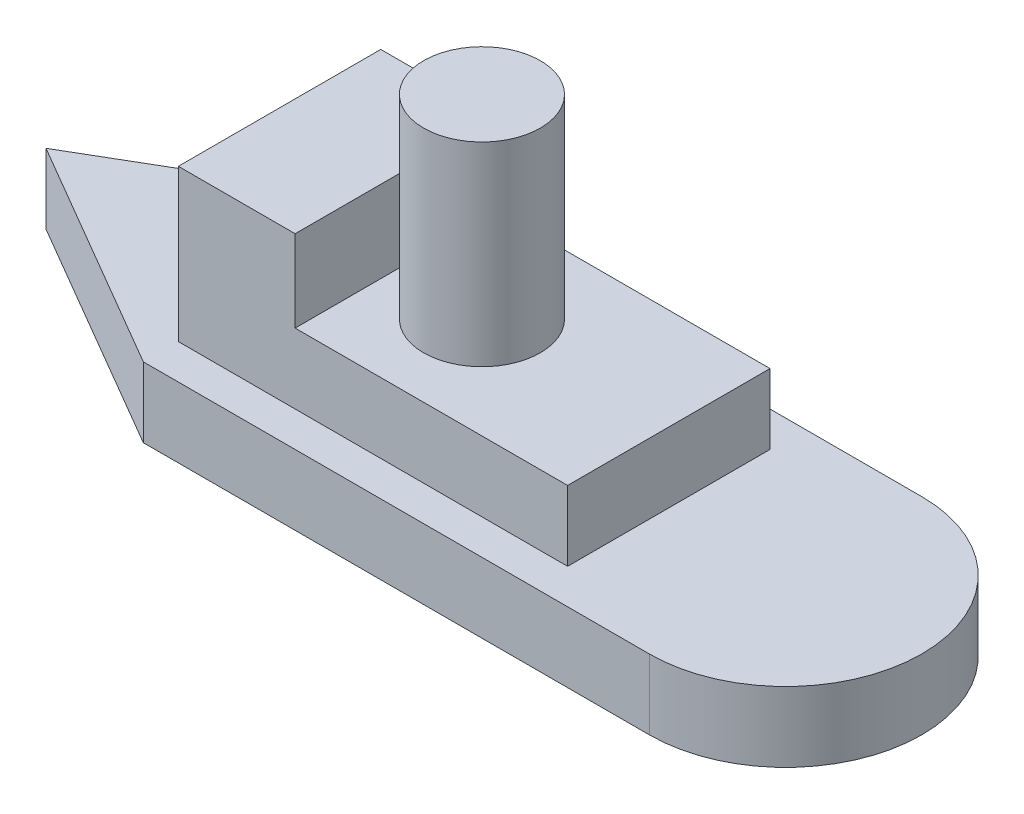
ISO-10303-21;
HEADER;
FILE_DESCRIPTION(('STEP AP214'),'2;1');
FILE_NAME('part.step','',(''),(''),'','','');
FILE_SCHEMA(('AUTOMOTIVE_DESIGN { 1 0 10303 214 1 1 1 1 }'));
ENDSEC;
DATA;
#1=APPLICATION_CONTEXT('core data for automotive mechanical design processes');
#2=APPLICATION_PROTOCOL_DEFINITION('international standard','automotive_design',2000,#1);
#3=PRODUCT_CONTEXT('',#1,'mechanical');
#4=PRODUCT('Part','Part','',(#3));
#5=PRODUCT_RELATED_PRODUCT_CATEGORY('part','',(#4));
#6=PRODUCT_DEFINITION_FORMATION('','',#4);
#7=PRODUCT_DEFINITION_CONTEXT('part definition',#1,'design');
#8=PRODUCT_DEFINITION('design','',#6,#7);
#9=PRODUCT_DEFINITION_SHAPE('','',#8);
#10=(LENGTH_UNIT() NAMED_UNIT(*) SI_UNIT(.MILLI.,.METRE.));
#11=(NAMED_UNIT(*) PLANE_ANGLE_UNIT() SI_UNIT($,.RADIAN.));
#12=(NAMED_UNIT(*) SI_UNIT($,.STERADIAN.) SOLID_ANGLE_UNIT());
#13=UNCERTAINTY_MEASURE_WITH_UNIT(LENGTH_MEASURE(1.E-05),#10,'distance_accuracy_value','');
#14=(GEOMETRIC_REPRESENTATION_CONTEXT(3) GLOBAL_UNCERTAINTY_ASSIGNED_CONTEXT((#13)) GLOBAL_UNIT_ASSIGNED_CONTEXT((#10,
#11,#12)) REPRESENTATION_CONTEXT('',''));
#15=CARTESIAN_POINT('',(0.,0.,0.));
#16=DIRECTION('',(0.,0.,1.));
#17=DIRECTION('',(1.,0.,0.));
#18=AXIS2_PLACEMENT_3D('',#15,#16,#17);
#19=CARTESIAN_POINT('',(0.,36.,0.));
#20=DIRECTION('',(0.,1.,0.));
#21=DIRECTION('',(0.,0.,1.));
#22=AXIS2_PLACEMENT_3D('',#19,#20,#21);
#23=PLANE('',#22);
#24=DIRECTION('',(0.,0.,-1.));
#25=VECTOR('',#24,1.);
#26=CARTESIAN_POINT('',(90.,36.,-26.));
#27=LINE('',#26,#25);
#28=CARTESIAN_POINT('',(90.,36.,26.));
#29=VERTEX_POINT('',#28);
#30=CARTESIAN_POINT('',(90.,36.,-26.));
#31=VERTEX_POINT('',#30);
#32=EDGE_CURVE('E52',#29,#31,#27,.T.);
#33=ORIENTED_EDGE('',*,*,#32,.F.);
#34=DIRECTION('',(1.,0.,0.));
#35=VECTOR('',#34,1.);
#36=CARTESIAN_POINT('',(60.,36.,26.));
#37=LINE('',#36,#35);
#38=CARTESIAN_POINT('',(160.,36.,26.));
#39=VERTEX_POINT('',#38);
#40=EDGE_CURVE('E177',#29,#39,#37,.T.);
#41=ORIENTED_EDGE('',*,*,#40,.T.);
#42=DIRECTION('',(0.,0.,-1.));
#43=VECTOR('',#42,1.);
#44=CARTESIAN_POINT('',(160.,36.,-26.));
#45=LINE('',#44,#43);
#46=CARTESIAN_POINT('',(160.,36.,-26.));
#47=VERTEX_POINT('',#46);
#48=EDGE_CURVE('E216',#39,#47,#45,.T.);
#49=ORIENTED_EDGE('',*,*,#48,.T.);
#50=DIRECTION('',(-1.,0.,0.));
#51=VECTOR('',#50,1.);
#52=CARTESIAN_POINT('',(60.,36.,-26.));
#53=LINE('',#52,#51);
#54=EDGE_CURVE('E160',#47,#31,#53,.T.);
#55=ORIENTED_EDGE('',*,*,#54,.T.);
#56=EDGE_LOOP('',(#33,#41,#49,#55));
#57=FACE_BOUND('',#56,.T.);
#58=CARTESIAN_POINT('',(112.,36.,0.));
#59=DIRECTION('',(0.,1.,0.));
#60=DIRECTION('',(0.,0.,1.));
#61=AXIS2_PLACEMENT_3D('',#58,#59,#60);
#62=CIRCLE('',#61,15.);
#63=CARTESIAN_POINT('',(112.,36.,15.));
#64=VERTEX_POINT('',#63);
#65=EDGE_CURVE('E148',#64,#64,#62,.T.);
#66=ORIENTED_EDGE('',*,*,#65,.F.);
#67=EDGE_LOOP('',(#66));
#68=FACE_BOUND('',#67,.T.);
#69=ADVANCED_FACE('F35',(#57,#68),#23,.T.);
#70=CARTESIAN_POINT('',(190.,18.,0.));
#71=DIRECTION('',(0.,-1.,0.));
#72=DIRECTION('',(0.,0.,-1.));
#73=AXIS2_PLACEMENT_3D('',#70,#71,#72);
#74=PLANE('',#73);
#75=DIRECTION('',(0.863778900898433,0.,0.503871025524086));
#76=VECTOR('',#75,1.);
#77=CARTESIAN_POINT('',(0.,18.,0.));
#78=LINE('',#77,#76);
#79=CARTESIAN_POINT('',(0.,18.,0.));
#80=VERTEX_POINT('',#79);
#81=CARTESIAN_POINT('',(60.,18.,35.));
#82=VERTEX_POINT('',#81);
#83=EDGE_CURVE('E185',#80,#82,#78,.T.);
#84=ORIENTED_EDGE('',*,*,#83,.T.);
#85=DIRECTION('',(1.,0.,0.));
#86=VECTOR('',#85,1.);
#87=CARTESIAN_POINT('',(190.,18.,35.));
#88=LINE('',#87,#86);
#89=CARTESIAN_POINT('',(190.,18.,35.));
#90=VERTEX_POINT('',#89);
#91=EDGE_CURVE('E188',#82,#90,#88,.T.);
#92=ORIENTED_EDGE('',*,*,#91,.T.);
#93=CARTESIAN_POINT('',(190.,18.,0.));
#94=DIRECTION('',(0.,1.,0.));
#95=DIRECTION('',(0.,0.,-1.));
#96=AXIS2_PLACEMENT_3D('',#93,#94,#95);
#97=CIRCLE('',#96,35.);
#98=CARTESIAN_POINT('',(190.,18.,-35.));
#99=VERTEX_POINT('',#98);
#100=EDGE_CURVE('E191',#90,#99,#97,.T.);
#101=ORIENTED_EDGE('',*,*,#100,.T.);
#102=DIRECTION('',(-1.,0.,0.));
#103=VECTOR('',#102,1.);
#104=CARTESIAN_POINT('',(190.,18.,-35.));
#105=LINE('',#104,#103);
#106=CARTESIAN_POINT('',(60.,18.,-35.));
#107=VERTEX_POINT('',#106);
#108=EDGE_CURVE('E193',#99,#107,#105,.T.);
#109=ORIENTED_EDGE('',*,*,#108,.T.);
#110=DIRECTION('',(-0.863778900898433,0.,0.503871025524086));
#111=VECTOR('',#110,1.);
#112=CARTESIAN_POINT('',(0.,18.,0.));
#113=LINE('',#112,#111);
#114=EDGE_CURVE('E195',#107,#80,#113,.T.);
#115=ORIENTED_EDGE('',*,*,#114,.T.);
#116=EDGE_LOOP('',(#84,#92,#101,#109,#115));
#117=FACE_BOUND('',#116,.T.);
#118=DIRECTION('',(0.,0.,1.));
#119=VECTOR('',#118,1.);
#120=CARTESIAN_POINT('',(60.,18.,-26.));
#121=LINE('',#120,#119);
#122=CARTESIAN_POINT('',(60.,18.,-26.));
#123=VERTEX_POINT('',#122);
#124=CARTESIAN_POINT('',(60.,18.,26.));
#125=VERTEX_POINT('',#124);
#126=EDGE_CURVE('E126',#123,#125,#121,.T.);
#127=ORIENTED_EDGE('',*,*,#126,.F.);
#128=DIRECTION('',(-1.,0.,0.));
#129=VECTOR('',#128,1.);
#130=CARTESIAN_POINT('',(60.,18.,-26.));
#131=LINE('',#130,#129);
#132=CARTESIAN_POINT('',(160.,18.,-26.));
#133=VERTEX_POINT('',#132);
#134=EDGE_CURVE('E174',#133,#123,#131,.T.);
#135=ORIENTED_EDGE('',*,*,#134,.F.);
#136=DIRECTION('',(0.,0.,-1.));
#137=VECTOR('',#136,1.);
#138=CARTESIAN_POINT('',(160.,18.,-26.));
#139=LINE('',#138,#137);
#140=CARTESIAN_POINT('',(160.,18.,26.));
#141=VERTEX_POINT('',#140);
#142=EDGE_CURVE('E168',#141,#133,#139,.T.);
#143=ORIENTED_EDGE('',*,*,#142,.F.);
#144=DIRECTION('',(1.,0.,0.));
#145=VECTOR('',#144,1.);
#146=CARTESIAN_POINT('',(60.,18.,26.));
#147=LINE('',#146,#145);
#148=EDGE_CURVE('E60',#125,#141,#147,.T.);
#149=ORIENTED_EDGE('',*,*,#148,.F.);
#150=EDGE_LOOP('',(#127,#135,#143,#149));
#151=FACE_BOUND('',#150,.T.);
#152=ADVANCED_FACE('F226',(#117,#151),#74,.F.);
#153=CARTESIAN_POINT('',(0.,18.,0.));
#154=DIRECTION('',(0.503871025524086,0.,-0.863778900898433));
#155=DIRECTION('',(-0.863778900898434,0.,-0.503871025524086));
#156=AXIS2_PLACEMENT_3D('',#153,#154,#155);
#157=PLANE('',#156);
#158=DIRECTION('',(0.863778900898433,0.,0.503871025524086));
#159=VECTOR('',#158,1.);
#160=CARTESIAN_POINT('',(0.,0.,0.));
#161=LINE('',#160,#159);
#162=CARTESIAN_POINT('',(0.,0.,0.));
#163=VERTEX_POINT('',#162);
#164=CARTESIAN_POINT('',(60.,0.,35.));
#165=VERTEX_POINT('',#164);
#166=EDGE_CURVE('E128',#163,#165,#161,.T.);
#167=ORIENTED_EDGE('',*,*,#166,.T.);
#168=DIRECTION('',(0.,-1.,0.));
#169=VECTOR('',#168,1.);
#170=CARTESIAN_POINT('',(60.,18.,35.));
#171=LINE('',#170,#169);
#172=EDGE_CURVE('E11',#82,#165,#171,.T.);
#173=ORIENTED_EDGE('',*,*,#172,.F.);
#174=ORIENTED_EDGE('',*,*,#83,.F.);
#175=DIRECTION('',(0.,-1.,0.));
#176=VECTOR('',#175,1.);
#177=CARTESIAN_POINT('',(0.,18.,0.));
#178=LINE('',#177,#176);
#179=EDGE_CURVE('E197',#80,#163,#178,.T.);
#180=ORIENTED_EDGE('',*,*,#179,.T.);
#181=EDGE_LOOP('',(#167,#173,#174,#180));
#182=FACE_BOUND('',#181,.T.);
#183=ADVANCED_FACE('F37',(#182),#157,.F.);
#184=CARTESIAN_POINT('',(190.,18.,35.));
#185=DIRECTION('',(0.,0.,-1.));
#186=DIRECTION('',(-1.,0.,0.));
#187=AXIS2_PLACEMENT_3D('',#184,#185,#186);
#188=PLANE('',#187);
#189=DIRECTION('',(1.,0.,0.));
#190=VECTOR('',#189,1.);
#191=CARTESIAN_POINT('',(190.,0.,35.));
#192=LINE('',#191,#190);
#193=CARTESIAN_POINT('',(190.,0.,35.));
#194=VERTEX_POINT('',#193);
#195=EDGE_CURVE('E200',#165,#194,#192,.T.);
#196=ORIENTED_EDGE('',*,*,#195,.T.);
#197=DIRECTION('',(0.,-1.,0.));
#198=VECTOR('',#197,1.);
#199=CARTESIAN_POINT('',(190.,18.,35.));
#200=LINE('',#199,#198);
#201=EDGE_CURVE('E44',#90,#194,#200,.T.);
#202=ORIENTED_EDGE('',*,*,#201,.F.);
#203=ORIENTED_EDGE('',*,*,#91,.F.);
#204=ORIENTED_EDGE('',*,*,#172,.T.);
#205=EDGE_LOOP('',(#196,#202,#203,#204));
#206=FACE_BOUND('',#205,.T.);
#207=ADVANCED_FACE('F350',(#206),#188,.F.);
#208=CARTESIAN_POINT('',(190.,18.,0.));
#209=DIRECTION('',(0.,-1.,0.));
#210=DIRECTION('',(0.,0.,-1.));
#211=AXIS2_PLACEMENT_3D('',#208,#209,#210);
#212=CYLINDRICAL_SURFACE('',#211,35.);
#213=CARTESIAN_POINT('',(190.,0.,0.));
#214=DIRECTION('',(0.,1.,0.));
#215=DIRECTION('',(0.,0.,-1.));
#216=AXIS2_PLACEMENT_3D('',#213,#214,#215);
#217=CIRCLE('',#216,35.);
#218=CARTESIAN_POINT('',(190.,0.,-35.));
#219=VERTEX_POINT('',#218);
#220=EDGE_CURVE('E202',#194,#219,#217,.T.);
#221=ORIENTED_EDGE('',*,*,#220,.T.);
#222=DIRECTION('',(0.,-1.,0.));
#223=VECTOR('',#222,1.);
#224=CARTESIAN_POINT('',(190.,18.,-35.));
#225=LINE('',#224,#223);
#226=EDGE_CURVE('E212',#99,#219,#225,.T.);
#227=ORIENTED_EDGE('',*,*,#226,.F.);
#228=ORIENTED_EDGE('',*,*,#100,.F.);
#229=ORIENTED_EDGE('',*,*,#201,.T.);
#230=EDGE_LOOP('',(#221,#227,#228,#229));
#231=FACE_BOUND('',#230,.T.);
#232=ADVANCED_FACE('F340',(#231),#212,.T.);
#233=CARTESIAN_POINT('',(190.,18.,-35.));
#234=DIRECTION('',(0.,0.,1.));
#235=DIRECTION('',(1.,0.,0.));
#236=AXIS2_PLACEMENT_3D('',#233,#234,#235);
#237=PLANE('',#236);
#238=DIRECTION('',(-1.,0.,0.));
#239=VECTOR('',#238,1.);
#240=CARTESIAN_POINT('',(190.,0.,-35.));
#241=LINE('',#240,#239);
#242=CARTESIAN_POINT('',(60.,0.,-35.));
#243=VERTEX_POINT('',#242);
#244=EDGE_CURVE('E204',#219,#243,#241,.T.);
#245=ORIENTED_EDGE('',*,*,#244,.T.);
#246=DIRECTION('',(0.,-1.,0.));
#247=VECTOR('',#246,1.);
#248=CARTESIAN_POINT('',(60.,18.,-35.));
#249=LINE('',#248,#247);
#250=EDGE_CURVE('E209',#107,#243,#249,.T.);
#251=ORIENTED_EDGE('',*,*,#250,.F.);
#252=ORIENTED_EDGE('',*,*,#108,.F.);
#253=ORIENTED_EDGE('',*,*,#226,.T.);
#254=EDGE_LOOP('',(#245,#251,#252,#253));
#255=FACE_BOUND('',#254,.T.);
#256=ADVANCED_FACE('F330',(#255),#237,.F.);
#257=CARTESIAN_POINT('',(0.,18.,0.));
#258=DIRECTION('',(0.503871025524086,0.,0.863778900898433));
#259=DIRECTION('',(0.863778900898434,0.,-0.503871025524086));
#260=AXIS2_PLACEMENT_3D('',#257,#258,#259);
#261=PLANE('',#260);
#262=DIRECTION('',(-0.863778900898433,0.,0.503871025524086));
#263=VECTOR('',#262,1.);
#264=CARTESIAN_POINT('',(0.,0.,0.));
#265=LINE('',#264,#263);
#266=EDGE_CURVE('E189',#243,#163,#265,.T.);
#267=ORIENTED_EDGE('',*,*,#266,.T.);
#268=ORIENTED_EDGE('',*,*,#179,.F.);
#269=ORIENTED_EDGE('',*,*,#114,.F.);
#270=ORIENTED_EDGE('',*,*,#250,.T.);
#271=EDGE_LOOP('',(#267,#268,#269,#270));
#272=FACE_BOUND('',#271,.T.);
#273=ADVANCED_FACE('F320',(#272),#261,.F.);
#274=CARTESIAN_POINT('',(190.,0.,0.));
#275=DIRECTION('',(0.,-1.,0.));
#276=DIRECTION('',(0.,0.,-1.));
#277=AXIS2_PLACEMENT_3D('',#274,#275,#276);
#278=PLANE('',#277);
#279=ORIENTED_EDGE('',*,*,#166,.F.);
#280=ORIENTED_EDGE('',*,*,#266,.F.);
#281=ORIENTED_EDGE('',*,*,#244,.F.);
#282=ORIENTED_EDGE('',*,*,#220,.F.);
#283=ORIENTED_EDGE('',*,*,#195,.F.);
#284=EDGE_LOOP('',(#279,#280,#281,#282,#283));
#285=FACE_BOUND('',#284,.T.);
#286=ADVANCED_FACE('F299',(#285),#278,.T.);
#287=CARTESIAN_POINT('',(60.,36.,-26.));
#288=DIRECTION('',(1.,0.,0.));
#289=DIRECTION('',(0.,0.,-1.));
#290=AXIS2_PLACEMENT_3D('',#287,#288,#289);
#291=PLANE('',#290);
#292=ORIENTED_EDGE('',*,*,#126,.T.);
#293=DIRECTION('',(0.,-1.,0.));
#294=VECTOR('',#293,1.);
#295=CARTESIAN_POINT('',(60.,36.,26.));
#296=LINE('',#295,#294);
#297=CARTESIAN_POINT('',(60.,57.,26.));
#298=VERTEX_POINT('',#297);
#299=EDGE_CURVE('E120',#298,#125,#296,.T.);
#300=ORIENTED_EDGE('',*,*,#299,.F.);
#301=DIRECTION('',(0.,0.,1.));
#302=VECTOR('',#301,1.);
#303=CARTESIAN_POINT('',(60.,57.,-26.));
#304=LINE('',#303,#302);
#305=CARTESIAN_POINT('',(60.,57.,-26.));
#306=VERTEX_POINT('',#305);
#307=EDGE_CURVE('E125',#306,#298,#304,.T.);
#308=ORIENTED_EDGE('',*,*,#307,.F.);
#309=DIRECTION('',(0.,-1.,0.));
#310=VECTOR('',#309,1.);
#311=CARTESIAN_POINT('',(60.,36.,-26.));
#312=LINE('',#311,#310);
#313=EDGE_CURVE('E178',#306,#123,#312,.T.);
#314=ORIENTED_EDGE('',*,*,#313,.T.);
#315=EDGE_LOOP('',(#292,#300,#308,#314));
#316=FACE_BOUND('',#315,.T.);
#317=ADVANCED_FACE('F122',(#316),#291,.F.);
#318=CARTESIAN_POINT('',(60.,36.,26.));
#319=DIRECTION('',(0.,0.,-1.));
#320=DIRECTION('',(-1.,0.,0.));
#321=AXIS2_PLACEMENT_3D('',#318,#319,#320);
#322=PLANE('',#321);
#323=ORIENTED_EDGE('',*,*,#148,.T.);
#324=DIRECTION('',(0.,-1.,0.));
#325=VECTOR('',#324,1.);
#326=CARTESIAN_POINT('',(160.,36.,26.));
#327=LINE('',#326,#325);
#328=EDGE_CURVE('E129',#39,#141,#327,.T.);
#329=ORIENTED_EDGE('',*,*,#328,.F.);
#330=ORIENTED_EDGE('',*,*,#40,.F.);
#331=DIRECTION('',(0.,-1.,0.));
#332=VECTOR('',#331,1.);
#333=CARTESIAN_POINT('',(90.,57.,26.));
#334=LINE('',#333,#332);
#335=CARTESIAN_POINT('',(90.,57.,26.));
#336=VERTEX_POINT('',#335);
#337=EDGE_CURVE('E135',#336,#29,#334,.T.);
#338=ORIENTED_EDGE('',*,*,#337,.F.);
#339=DIRECTION('',(1.,0.,0.));
#340=VECTOR('',#339,1.);
#341=CARTESIAN_POINT('',(60.,57.,26.));
#342=LINE('',#341,#340);
#343=EDGE_CURVE('E132',#298,#336,#342,.T.);
#344=ORIENTED_EDGE('',*,*,#343,.F.);
#345=ORIENTED_EDGE('',*,*,#299,.T.);
#346=EDGE_LOOP('',(#323,#329,#330,#338,#344,#345));
#347=FACE_BOUND('',#346,.T.);
#348=ADVANCED_FACE('F133',(#347),#322,.F.);
#349=CARTESIAN_POINT('',(160.,36.,-26.));
#350=DIRECTION('',(-1.,0.,0.));
#351=DIRECTION('',(0.,0.,1.));
#352=AXIS2_PLACEMENT_3D('',#349,#350,#351);
#353=PLANE('',#352);
#354=ORIENTED_EDGE('',*,*,#142,.T.);
#355=DIRECTION('',(0.,-1.,0.));
#356=VECTOR('',#355,1.);
#357=CARTESIAN_POINT('',(160.,36.,-26.));
#358=LINE('',#357,#356);
#359=EDGE_CURVE('E180',#47,#133,#358,.T.);
#360=ORIENTED_EDGE('',*,*,#359,.F.);
#361=ORIENTED_EDGE('',*,*,#48,.F.);
#362=ORIENTED_EDGE('',*,*,#328,.T.);
#363=EDGE_LOOP('',(#354,#360,#361,#362));
#364=FACE_BOUND('',#363,.T.);
#365=ADVANCED_FACE('F228',(#364),#353,.F.);
#366=CARTESIAN_POINT('',(60.,36.,-26.));
#367=DIRECTION('',(0.,0.,1.));
#368=DIRECTION('',(1.,0.,0.));
#369=AXIS2_PLACEMENT_3D('',#366,#367,#368);
#370=PLANE('',#369);
#371=ORIENTED_EDGE('',*,*,#134,.T.);
#372=ORIENTED_EDGE('',*,*,#313,.F.);
#373=DIRECTION('',(-1.,0.,0.));
#374=VECTOR('',#373,1.);
#375=CARTESIAN_POINT('',(60.,57.,-26.));
#376=LINE('',#375,#374);
#377=CARTESIAN_POINT('',(90.,57.,-26.));
#378=VERTEX_POINT('',#377);
#379=EDGE_CURVE('E143',#378,#306,#376,.T.);
#380=ORIENTED_EDGE('',*,*,#379,.F.);
#381=DIRECTION('',(0.,-1.,0.));
#382=VECTOR('',#381,1.);
#383=CARTESIAN_POINT('',(90.,57.,-26.));
#384=LINE('',#383,#382);
#385=EDGE_CURVE('E153',#378,#31,#384,.T.);
#386=ORIENTED_EDGE('',*,*,#385,.T.);
#387=ORIENTED_EDGE('',*,*,#54,.F.);
#388=ORIENTED_EDGE('',*,*,#359,.T.);
#389=EDGE_LOOP('',(#371,#372,#380,#386,#387,#388));
#390=FACE_BOUND('',#389,.T.);
#391=ADVANCED_FACE('F225',(#390),#370,.F.);
#392=CARTESIAN_POINT('',(90.,57.,-26.));
#393=DIRECTION('',(-1.,0.,0.));
#394=DIRECTION('',(0.,0.,1.));
#395=AXIS2_PLACEMENT_3D('',#392,#393,#394);
#396=PLANE('',#395);
#397=ORIENTED_EDGE('',*,*,#32,.T.);
#398=ORIENTED_EDGE('',*,*,#385,.F.);
#399=DIRECTION('',(0.,0.,-1.));
#400=VECTOR('',#399,1.);
#401=CARTESIAN_POINT('',(90.,57.,-26.));
#402=LINE('',#401,#400);
#403=EDGE_CURVE('E138',#336,#378,#402,.T.);
#404=ORIENTED_EDGE('',*,*,#403,.F.);
#405=ORIENTED_EDGE('',*,*,#337,.T.);
#406=EDGE_LOOP('',(#397,#398,#404,#405));
#407=FACE_BOUND('',#406,.T.);
#408=ADVANCED_FACE('F224',(#407),#396,.F.);
#409=CARTESIAN_POINT('',(0.,57.,0.));
#410=DIRECTION('',(0.,1.,0.));
#411=DIRECTION('',(0.,0.,1.));
#412=AXIS2_PLACEMENT_3D('',#409,#410,#411);
#413=PLANE('',#412);
#414=ORIENTED_EDGE('',*,*,#307,.T.);
#415=ORIENTED_EDGE('',*,*,#343,.T.);
#416=ORIENTED_EDGE('',*,*,#403,.T.);
#417=ORIENTED_EDGE('',*,*,#379,.T.);
#418=EDGE_LOOP('',(#414,#415,#416,#417));
#419=FACE_BOUND('',#418,.T.);
#420=ADVANCED_FACE('F141',(#419),#413,.T.);
#421=CARTESIAN_POINT('',(112.,86.,0.));
#422=DIRECTION('',(0.,-1.,0.));
#423=DIRECTION('',(0.,0.,-1.));
#424=AXIS2_PLACEMENT_3D('',#421,#422,#423);
#425=CYLINDRICAL_SURFACE('',#424,15.);
#426=CARTESIAN_POINT('',(112.,86.,0.));
#427=DIRECTION('',(0.,1.,0.));
#428=DIRECTION('',(0.,0.,1.));
#429=AXIS2_PLACEMENT_3D('',#426,#427,#428);
#430=CIRCLE('',#429,15.);
#431=CARTESIAN_POINT('',(112.,86.,15.));
#432=VERTEX_POINT('',#431);
#433=EDGE_CURVE('E145',#432,#432,#430,.T.);
#434=ORIENTED_EDGE('',*,*,#433,.F.);
#435=EDGE_LOOP('',(#434));
#436=FACE_BOUND('',#435,.T.);
#437=ORIENTED_EDGE('',*,*,#65,.T.);
#438=EDGE_LOOP('',(#437));
#439=FACE_BOUND('',#438,.T.);
#440=ADVANCED_FACE('F249',(#436,#439),#425,.T.);
#441=CARTESIAN_POINT('',(112.,86.,0.));
#442=DIRECTION('',(0.,1.,0.));
#443=DIRECTION('',(0.,0.,1.));
#444=AXIS2_PLACEMENT_3D('',#441,#442,#443);
#445=PLANE('',#444);
#446=ORIENTED_EDGE('',*,*,#433,.T.);
#447=EDGE_LOOP('',(#446));
#448=FACE_BOUND('',#447,.T.);
#449=ADVANCED_FACE('F252',(#448),#445,.T.);
#450=CLOSED_SHELL('',(#69,#152,#183,#207,#232,#256,#273,#286,#317,#348,#365,#391,#408,#420,#440,#449));
#451=MANIFOLD_SOLID_BREP('B2',#450);
#452=ADVANCED_BREP_SHAPE_REPRESENTATION('',(#18,#451),#14);
#453=SHAPE_DEFINITION_REPRESENTATION(#9,#452);
ENDSEC;
END-ISO-10303-21;
